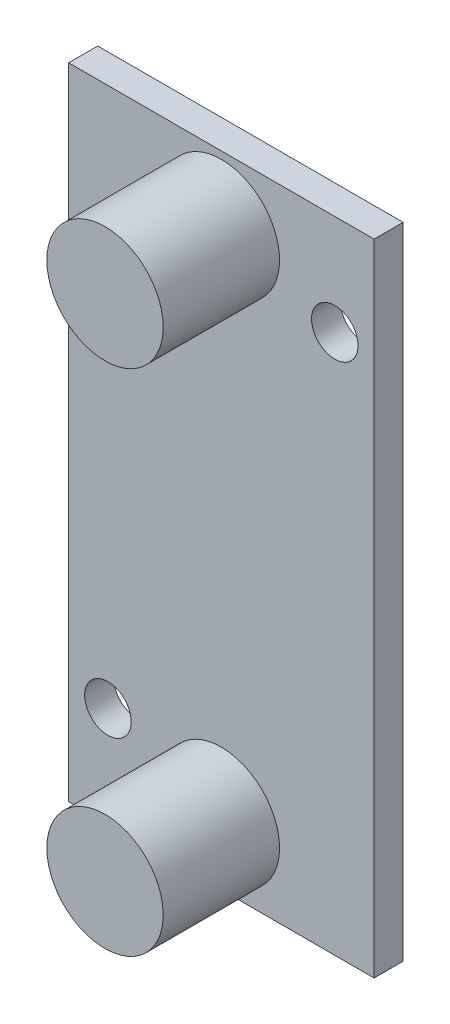
ISO-10303-21;
HEADER;
FILE_DESCRIPTION(('STEP AP214'),'2;1');
FILE_NAME('part.step','',(''),(''),'','','');
FILE_SCHEMA(('AUTOMOTIVE_DESIGN { 1 0 10303 214 1 1 1 1 }'));
ENDSEC;
DATA;
#1=APPLICATION_CONTEXT('core data for automotive mechanical design processes');
#2=APPLICATION_PROTOCOL_DEFINITION('international standard','automotive_design',2000,#1);
#3=PRODUCT_CONTEXT('',#1,'mechanical');
#4=PRODUCT('Part','Part','',(#3));
#5=PRODUCT_RELATED_PRODUCT_CATEGORY('part','',(#4));
#6=PRODUCT_DEFINITION_FORMATION('','',#4);
#7=PRODUCT_DEFINITION_CONTEXT('part definition',#1,'design');
#8=PRODUCT_DEFINITION('design','',#6,#7);
#9=PRODUCT_DEFINITION_SHAPE('','',#8);
#10=(LENGTH_UNIT() NAMED_UNIT(*) SI_UNIT(.MILLI.,.METRE.));
#11=(NAMED_UNIT(*) PLANE_ANGLE_UNIT() SI_UNIT($,.RADIAN.));
#12=(NAMED_UNIT(*) SI_UNIT($,.STERADIAN.) SOLID_ANGLE_UNIT());
#13=UNCERTAINTY_MEASURE_WITH_UNIT(LENGTH_MEASURE(1.E-05),#10,'distance_accuracy_value','');
#14=(GEOMETRIC_REPRESENTATION_CONTEXT(3) GLOBAL_UNCERTAINTY_ASSIGNED_CONTEXT((#13)) GLOBAL_UNIT_ASSIGNED_CONTEXT((#10,
#11,#12)) REPRESENTATION_CONTEXT('',''));
#15=CARTESIAN_POINT('',(0.,0.,0.));
#16=DIRECTION('',(0.,0.,1.));
#17=DIRECTION('',(1.,0.,0.));
#18=AXIS2_PLACEMENT_3D('',#15,#16,#17);
#19=CARTESIAN_POINT('',(0.,0.,2.));
#20=DIRECTION('',(1.,0.,0.));
#21=DIRECTION('',(0.,0.,-1.));
#22=AXIS2_PLACEMENT_3D('',#19,#20,#21);
#23=PLANE('',#22);
#24=DIRECTION('',(0.,-1.,0.));
#25=VECTOR('',#24,1.);
#26=CARTESIAN_POINT('',(0.,0.,0.));
#27=LINE('',#26,#25);
#28=CARTESIAN_POINT('',(0.,44.,0.));
#29=VERTEX_POINT('',#28);
#30=CARTESIAN_POINT('',(0.,0.,0.));
#31=VERTEX_POINT('',#30);
#32=EDGE_CURVE('E100',#29,#31,#27,.T.);
#33=ORIENTED_EDGE('',*,*,#32,.T.);
#34=DIRECTION('',(0.,0.,-1.));
#35=VECTOR('',#34,1.);
#36=CARTESIAN_POINT('',(0.,0.,2.));
#37=LINE('',#36,#35);
#38=CARTESIAN_POINT('',(0.,0.,2.));
#39=VERTEX_POINT('',#38);
#40=EDGE_CURVE('E91',#39,#31,#37,.T.);
#41=ORIENTED_EDGE('',*,*,#40,.F.);
#42=DIRECTION('',(0.,-1.,0.));
#43=VECTOR('',#42,1.);
#44=CARTESIAN_POINT('',(0.,0.,2.));
#45=LINE('',#44,#43);
#46=CARTESIAN_POINT('',(0.,44.,2.));
#47=VERTEX_POINT('',#46);
#48=EDGE_CURVE('E85',#47,#39,#45,.T.);
#49=ORIENTED_EDGE('',*,*,#48,.F.);
#50=DIRECTION('',(0.,0.,-1.));
#51=VECTOR('',#50,1.);
#52=CARTESIAN_POINT('',(0.,44.,2.));
#53=LINE('',#52,#51);
#54=EDGE_CURVE('E96',#47,#29,#53,.T.);
#55=ORIENTED_EDGE('',*,*,#54,.T.);
#56=EDGE_LOOP('',(#33,#41,#49,#55));
#57=FACE_BOUND('',#56,.T.);
#58=ADVANCED_FACE('F33',(#57),#23,.F.);
#59=CARTESIAN_POINT('',(0.,0.,2.));
#60=DIRECTION('',(0.,1.,0.));
#61=DIRECTION('',(0.,0.,1.));
#62=AXIS2_PLACEMENT_3D('',#59,#60,#61);
#63=PLANE('',#62);
#64=DIRECTION('',(1.,0.,0.));
#65=VECTOR('',#64,1.);
#66=CARTESIAN_POINT('',(0.,0.,0.));
#67=LINE('',#66,#65);
#68=CARTESIAN_POINT('',(21.,0.,0.));
#69=VERTEX_POINT('',#68);
#70=EDGE_CURVE('E90',#31,#69,#67,.T.);
#71=ORIENTED_EDGE('',*,*,#70,.T.);
#72=DIRECTION('',(0.,0.,-1.));
#73=VECTOR('',#72,1.);
#74=CARTESIAN_POINT('',(21.,0.,2.));
#75=LINE('',#74,#73);
#76=CARTESIAN_POINT('',(21.,0.,2.));
#77=VERTEX_POINT('',#76);
#78=EDGE_CURVE('E88',#77,#69,#75,.T.);
#79=ORIENTED_EDGE('',*,*,#78,.F.);
#80=DIRECTION('',(1.,0.,0.));
#81=VECTOR('',#80,1.);
#82=CARTESIAN_POINT('',(0.,0.,2.));
#83=LINE('',#82,#81);
#84=EDGE_CURVE('E80',#39,#77,#83,.T.);
#85=ORIENTED_EDGE('',*,*,#84,.F.);
#86=ORIENTED_EDGE('',*,*,#40,.T.);
#87=EDGE_LOOP('',(#71,#79,#85,#86));
#88=FACE_BOUND('',#87,.T.);
#89=ADVANCED_FACE('F89',(#88),#63,.F.);
#90=CARTESIAN_POINT('',(21.,0.,2.));
#91=DIRECTION('',(-1.,0.,0.));
#92=DIRECTION('',(0.,0.,1.));
#93=AXIS2_PLACEMENT_3D('',#90,#91,#92);
#94=PLANE('',#93);
#95=DIRECTION('',(0.,1.,0.));
#96=VECTOR('',#95,1.);
#97=CARTESIAN_POINT('',(21.,0.,0.));
#98=LINE('',#97,#96);
#99=CARTESIAN_POINT('',(21.,44.,0.));
#100=VERTEX_POINT('',#99);
#101=EDGE_CURVE('E66',#69,#100,#98,.T.);
#102=ORIENTED_EDGE('',*,*,#101,.T.);
#103=DIRECTION('',(0.,0.,-1.));
#104=VECTOR('',#103,1.);
#105=CARTESIAN_POINT('',(21.,44.,2.));
#106=LINE('',#105,#104);
#107=CARTESIAN_POINT('',(21.,44.,2.));
#108=VERTEX_POINT('',#107);
#109=EDGE_CURVE('E92',#108,#100,#106,.T.);
#110=ORIENTED_EDGE('',*,*,#109,.F.);
#111=DIRECTION('',(0.,1.,0.));
#112=VECTOR('',#111,1.);
#113=CARTESIAN_POINT('',(21.,0.,2.));
#114=LINE('',#113,#112);
#115=EDGE_CURVE('E83',#77,#108,#114,.T.);
#116=ORIENTED_EDGE('',*,*,#115,.F.);
#117=ORIENTED_EDGE('',*,*,#78,.T.);
#118=EDGE_LOOP('',(#102,#110,#116,#117));
#119=FACE_BOUND('',#118,.T.);
#120=ADVANCED_FACE('F94',(#119),#94,.F.);
#121=CARTESIAN_POINT('',(0.,44.,2.));
#122=DIRECTION('',(0.,-1.,0.));
#123=DIRECTION('',(0.,0.,-1.));
#124=AXIS2_PLACEMENT_3D('',#121,#122,#123);
#125=PLANE('',#124);
#126=DIRECTION('',(-1.,0.,0.));
#127=VECTOR('',#126,1.);
#128=CARTESIAN_POINT('',(0.,44.,0.));
#129=LINE('',#128,#127);
#130=EDGE_CURVE('E72',#100,#29,#129,.T.);
#131=ORIENTED_EDGE('',*,*,#130,.T.);
#132=ORIENTED_EDGE('',*,*,#54,.F.);
#133=DIRECTION('',(-1.,0.,0.));
#134=VECTOR('',#133,1.);
#135=CARTESIAN_POINT('',(0.,44.,2.));
#136=LINE('',#135,#134);
#137=EDGE_CURVE('E49',#108,#47,#136,.T.);
#138=ORIENTED_EDGE('',*,*,#137,.F.);
#139=ORIENTED_EDGE('',*,*,#109,.T.);
#140=EDGE_LOOP('',(#131,#132,#138,#139));
#141=FACE_BOUND('',#140,.T.);
#142=ADVANCED_FACE('F117',(#141),#125,.F.);
#143=CARTESIAN_POINT('',(0.,0.,2.));
#144=DIRECTION('',(0.,0.,-1.));
#145=DIRECTION('',(-1.,0.,0.));
#146=AXIS2_PLACEMENT_3D('',#143,#144,#145);
#147=PLANE('',#146);
#148=CARTESIAN_POINT('',(10.5,4.49999999999999,2.));
#149=DIRECTION('',(0.,0.,-1.));
#150=DIRECTION('',(-1.,0.,0.));
#151=AXIS2_PLACEMENT_3D('',#148,#149,#150);
#152=CIRCLE('',#151,4.);
#153=CARTESIAN_POINT('',(6.49999999999999,4.49999999999999,2.));
#154=VERTEX_POINT('',#153);
#155=EDGE_CURVE('E11',#154,#154,#152,.F.);
#156=ORIENTED_EDGE('',*,*,#155,.F.);
#157=EDGE_LOOP('',(#156));
#158=FACE_BOUND('',#157,.T.);
#159=CARTESIAN_POINT('',(10.5,39.5,2.));
#160=DIRECTION('',(0.,0.,-1.));
#161=DIRECTION('',(-1.,0.,0.));
#162=AXIS2_PLACEMENT_3D('',#159,#160,#161);
#163=CIRCLE('',#162,4.);
#164=CARTESIAN_POINT('',(6.5,39.5,2.));
#165=VERTEX_POINT('',#164);
#166=EDGE_CURVE('E41',#165,#165,#163,.F.);
#167=ORIENTED_EDGE('',*,*,#166,.F.);
#168=EDGE_LOOP('',(#167));
#169=FACE_BOUND('',#168,.T.);
#170=CARTESIAN_POINT('',(2.7,6.9,2.));
#171=DIRECTION('',(0.,0.,1.));
#172=DIRECTION('',(1.,0.,0.));
#173=AXIS2_PLACEMENT_3D('',#170,#171,#172);
#174=CIRCLE('',#173,1.6);
#175=CARTESIAN_POINT('',(4.3,6.9,2.));
#176=VERTEX_POINT('',#175);
#177=EDGE_CURVE('E123',#176,#176,#174,.T.);
#178=ORIENTED_EDGE('',*,*,#177,.F.);
#179=EDGE_LOOP('',(#178));
#180=FACE_BOUND('',#179,.T.);
#181=CARTESIAN_POINT('',(18.3,37.1,2.));
#182=DIRECTION('',(0.,0.,1.));
#183=DIRECTION('',(1.,0.,0.));
#184=AXIS2_PLACEMENT_3D('',#181,#182,#183);
#185=CIRCLE('',#184,1.6);
#186=CARTESIAN_POINT('',(19.9,37.1,2.));
#187=VERTEX_POINT('',#186);
#188=EDGE_CURVE('E126',#187,#187,#185,.T.);
#189=ORIENTED_EDGE('',*,*,#188,.F.);
#190=EDGE_LOOP('',(#189));
#191=FACE_BOUND('',#190,.T.);
#192=ORIENTED_EDGE('',*,*,#48,.T.);
#193=ORIENTED_EDGE('',*,*,#84,.T.);
#194=ORIENTED_EDGE('',*,*,#115,.T.);
#195=ORIENTED_EDGE('',*,*,#137,.T.);
#196=EDGE_LOOP('',(#192,#193,#194,#195));
#197=FACE_BOUND('',#196,.T.);
#198=ADVANCED_FACE('F81',(#158,#169,#180,#191,#197),#147,.F.);
#199=CARTESIAN_POINT('',(0.,0.,0.));
#200=DIRECTION('',(0.,0.,-1.));
#201=DIRECTION('',(-1.,0.,0.));
#202=AXIS2_PLACEMENT_3D('',#199,#200,#201);
#203=PLANE('',#202);
#204=CARTESIAN_POINT('',(2.7,6.9,0.));
#205=DIRECTION('',(0.,0.,1.));
#206=DIRECTION('',(1.,0.,0.));
#207=AXIS2_PLACEMENT_3D('',#204,#205,#206);
#208=CIRCLE('',#207,1.6);
#209=CARTESIAN_POINT('',(4.3,6.9,0.));
#210=VERTEX_POINT('',#209);
#211=EDGE_CURVE('E128',#210,#210,#208,.T.);
#212=ORIENTED_EDGE('',*,*,#211,.T.);
#213=EDGE_LOOP('',(#212));
#214=FACE_BOUND('',#213,.T.);
#215=CARTESIAN_POINT('',(18.3,37.1,0.));
#216=DIRECTION('',(0.,0.,1.));
#217=DIRECTION('',(1.,0.,0.));
#218=AXIS2_PLACEMENT_3D('',#215,#216,#217);
#219=CIRCLE('',#218,1.6);
#220=CARTESIAN_POINT('',(19.9,37.1,0.));
#221=VERTEX_POINT('',#220);
#222=EDGE_CURVE('E103',#221,#221,#219,.T.);
#223=ORIENTED_EDGE('',*,*,#222,.T.);
#224=EDGE_LOOP('',(#223));
#225=FACE_BOUND('',#224,.T.);
#226=ORIENTED_EDGE('',*,*,#32,.F.);
#227=ORIENTED_EDGE('',*,*,#130,.F.);
#228=ORIENTED_EDGE('',*,*,#101,.F.);
#229=ORIENTED_EDGE('',*,*,#70,.F.);
#230=EDGE_LOOP('',(#226,#227,#228,#229));
#231=FACE_BOUND('',#230,.T.);
#232=ADVANCED_FACE('F116',(#214,#225,#231),#203,.T.);
#233=CARTESIAN_POINT('',(18.3,37.1,0.));
#234=DIRECTION('',(0.,0.,1.));
#235=DIRECTION('',(1.,0.,0.));
#236=AXIS2_PLACEMENT_3D('',#233,#234,#235);
#237=CYLINDRICAL_SURFACE('',#236,1.6);
#238=ORIENTED_EDGE('',*,*,#222,.F.);
#239=EDGE_LOOP('',(#238));
#240=FACE_BOUND('',#239,.T.);
#241=ORIENTED_EDGE('',*,*,#188,.T.);
#242=EDGE_LOOP('',(#241));
#243=FACE_BOUND('',#242,.T.);
#244=ADVANCED_FACE('F166',(#240,#243),#237,.F.);
#245=CARTESIAN_POINT('',(2.7,6.9,0.));
#246=DIRECTION('',(0.,0.,1.));
#247=DIRECTION('',(1.,0.,0.));
#248=AXIS2_PLACEMENT_3D('',#245,#246,#247);
#249=CYLINDRICAL_SURFACE('',#248,1.6);
#250=ORIENTED_EDGE('',*,*,#211,.F.);
#251=EDGE_LOOP('',(#250));
#252=FACE_BOUND('',#251,.T.);
#253=ORIENTED_EDGE('',*,*,#177,.T.);
#254=EDGE_LOOP('',(#253));
#255=FACE_BOUND('',#254,.T.);
#256=ADVANCED_FACE('F172',(#252,#255),#249,.F.);
#257=CARTESIAN_POINT('',(10.5,39.5,10.));
#258=DIRECTION('',(0.,0.,-1.));
#259=DIRECTION('',(-1.,0.,0.));
#260=AXIS2_PLACEMENT_3D('',#257,#258,#259);
#261=CYLINDRICAL_SURFACE('',#260,4.);
#262=CARTESIAN_POINT('',(10.5,39.5,10.));
#263=DIRECTION('',(0.,0.,1.));
#264=DIRECTION('',(1.,0.,0.));
#265=AXIS2_PLACEMENT_3D('',#262,#263,#264);
#266=CIRCLE('',#265,4.);
#267=CARTESIAN_POINT('',(14.5,39.5,10.));
#268=VERTEX_POINT('',#267);
#269=EDGE_CURVE('E135',#268,#268,#266,.T.);
#270=ORIENTED_EDGE('',*,*,#269,.F.);
#271=EDGE_LOOP('',(#270));
#272=FACE_BOUND('',#271,.T.);
#273=ORIENTED_EDGE('',*,*,#166,.T.);
#274=EDGE_LOOP('',(#273));
#275=FACE_BOUND('',#274,.T.);
#276=ADVANCED_FACE('F112',(#272,#275),#261,.T.);
#277=CARTESIAN_POINT('',(10.5,39.5,10.));
#278=DIRECTION('',(0.,0.,1.));
#279=DIRECTION('',(1.,0.,0.));
#280=AXIS2_PLACEMENT_3D('',#277,#278,#279);
#281=PLANE('',#280);
#282=ORIENTED_EDGE('',*,*,#269,.T.);
#283=EDGE_LOOP('',(#282));
#284=FACE_BOUND('',#283,.T.);
#285=ADVANCED_FACE('F148',(#284),#281,.T.);
#286=CARTESIAN_POINT('',(10.5,4.49999999999999,10.));
#287=DIRECTION('',(0.,0.,-1.));
#288=DIRECTION('',(-1.,0.,0.));
#289=AXIS2_PLACEMENT_3D('',#286,#287,#288);
#290=CYLINDRICAL_SURFACE('',#289,4.);
#291=CARTESIAN_POINT('',(10.5,4.49999999999999,10.));
#292=DIRECTION('',(0.,0.,1.));
#293=DIRECTION('',(-1.,0.,0.));
#294=AXIS2_PLACEMENT_3D('',#291,#292,#293);
#295=CIRCLE('',#294,4.);
#296=CARTESIAN_POINT('',(6.49999999999999,4.49999999999999,10.));
#297=VERTEX_POINT('',#296);
#298=EDGE_CURVE('E139',#297,#297,#295,.T.);
#299=ORIENTED_EDGE('',*,*,#298,.F.);
#300=EDGE_LOOP('',(#299));
#301=FACE_BOUND('',#300,.T.);
#302=ORIENTED_EDGE('',*,*,#155,.T.);
#303=EDGE_LOOP('',(#302));
#304=FACE_BOUND('',#303,.T.);
#305=ADVANCED_FACE('F145',(#301,#304),#290,.T.);
#306=CARTESIAN_POINT('',(10.5,4.49999999999999,10.));
#307=DIRECTION('',(0.,0.,-1.));
#308=DIRECTION('',(-1.,0.,0.));
#309=AXIS2_PLACEMENT_3D('',#306,#307,#308);
#310=PLANE('',#309);
#311=ORIENTED_EDGE('',*,*,#298,.T.);
#312=EDGE_LOOP('',(#311));
#313=FACE_BOUND('',#312,.T.);
#314=ADVANCED_FACE('F143',(#313),#310,.F.);
#315=CLOSED_SHELL('',(#58,#89,#120,#142,#198,#232,#244,#256,#276,#285,#305,#314));
#316=MANIFOLD_SOLID_BREP('B2',#315);
#317=ADVANCED_BREP_SHAPE_REPRESENTATION('',(#18,#316),#14);
#318=SHAPE_DEFINITION_REPRESENTATION(#9,#317);
ENDSEC;
END-ISO-10303-21;
